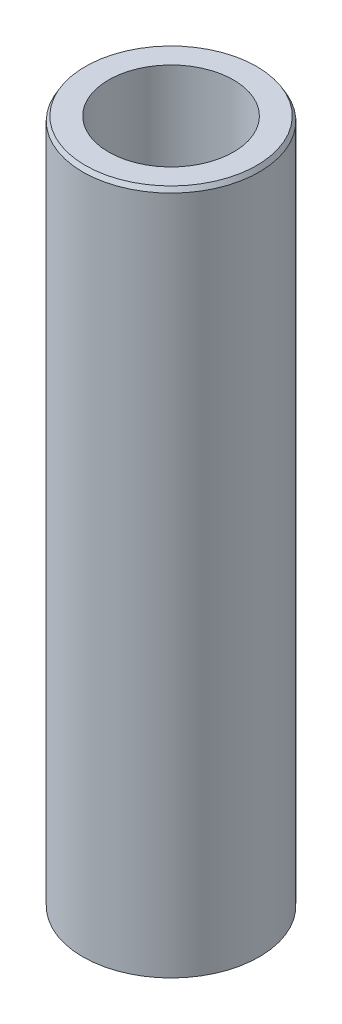
ISO-10303-21;
HEADER;
FILE_DESCRIPTION(('STEP AP214'),'2;1');
FILE_NAME('part.step','',(''),(''),'','','');
FILE_SCHEMA(('AUTOMOTIVE_DESIGN { 1 0 10303 214 1 1 1 1 }'));
ENDSEC;
DATA;
#1=APPLICATION_CONTEXT('core data for automotive mechanical design processes');
#2=APPLICATION_PROTOCOL_DEFINITION('international standard','automotive_design',2000,#1);
#3=PRODUCT_CONTEXT('',#1,'mechanical');
#4=PRODUCT('Part','Part','',(#3));
#5=PRODUCT_RELATED_PRODUCT_CATEGORY('part','',(#4));
#6=PRODUCT_DEFINITION_FORMATION('','',#4);
#7=PRODUCT_DEFINITION_CONTEXT('part definition',#1,'design');
#8=PRODUCT_DEFINITION('design','',#6,#7);
#9=PRODUCT_DEFINITION_SHAPE('','',#8);
#10=(LENGTH_UNIT() NAMED_UNIT(*) SI_UNIT(.MILLI.,.METRE.));
#11=(NAMED_UNIT(*) PLANE_ANGLE_UNIT() SI_UNIT($,.RADIAN.));
#12=(NAMED_UNIT(*) SI_UNIT($,.STERADIAN.) SOLID_ANGLE_UNIT());
#13=UNCERTAINTY_MEASURE_WITH_UNIT(LENGTH_MEASURE(1.E-05),#10,'distance_accuracy_value','');
#14=(GEOMETRIC_REPRESENTATION_CONTEXT(3) GLOBAL_UNCERTAINTY_ASSIGNED_CONTEXT((#13)) GLOBAL_UNIT_ASSIGNED_CONTEXT((#10,
#11,#12)) REPRESENTATION_CONTEXT('',''));
#15=CARTESIAN_POINT('',(0.,0.,0.));
#16=DIRECTION('',(0.,0.,1.));
#17=DIRECTION('',(1.,0.,0.));
#18=AXIS2_PLACEMENT_3D('',#15,#16,#17);
#19=CARTESIAN_POINT('',(0.,194.478352322932,0.));
#20=DIRECTION('',(0.,-1.,0.));
#21=DIRECTION('',(0.,0.,-1.));
#22=AXIS2_PLACEMENT_3D('',#19,#20,#21);
#23=CYLINDRICAL_SURFACE('',#22,25.);
#24=CARTESIAN_POINT('',(0.,193.229659015917,0.));
#25=DIRECTION('',(0.,1.,0.));
#26=DIRECTION('',(0.,0.,1.));
#27=AXIS2_PLACEMENT_3D('',#24,#25,#26);
#28=CIRCLE('',#27,25.);
#29=CARTESIAN_POINT('',(0.,193.229659015917,25.));
#30=VERTEX_POINT('',#29);
#31=EDGE_CURVE('E50',#30,#30,#28,.F.);
#32=ORIENTED_EDGE('',*,*,#31,.T.);
#33=EDGE_LOOP('',(#32));
#34=FACE_BOUND('',#33,.T.);
#35=CARTESIAN_POINT('',(0.,0.720933416940378,0.));
#36=DIRECTION('',(0.,1.,0.));
#37=DIRECTION('',(0.,0.,1.));
#38=AXIS2_PLACEMENT_3D('',#35,#36,#37);
#39=CIRCLE('',#38,25.);
#40=CARTESIAN_POINT('',(0.,0.720933416940378,25.));
#41=VERTEX_POINT('',#40);
#42=EDGE_CURVE('E51',#41,#41,#39,.T.);
#43=ORIENTED_EDGE('',*,*,#42,.T.);
#44=EDGE_LOOP('',(#43));
#45=FACE_BOUND('',#44,.T.);
#46=ADVANCED_FACE('F39',(#34,#45),#23,.T.);
#47=CARTESIAN_POINT('',(0.,194.478352322932,0.));
#48=DIRECTION('',(0.,1.,0.));
#49=DIRECTION('',(0.,0.,1.));
#50=AXIS2_PLACEMENT_3D('',#47,#48,#49);
#51=PLANE('',#50);
#52=CARTESIAN_POINT('',(0.,194.478352322932,0.));
#53=DIRECTION('',(0.,1.,0.));
#54=DIRECTION('',(0.,0.,1.));
#55=AXIS2_PLACEMENT_3D('',#52,#53,#54);
#56=CIRCLE('',#55,24.2790665830596);
#57=CARTESIAN_POINT('',(0.,194.478352322932,24.2790665830596));
#58=VERTEX_POINT('',#57);
#59=EDGE_CURVE('E54',#58,#58,#56,.T.);
#60=ORIENTED_EDGE('',*,*,#59,.T.);
#61=EDGE_LOOP('',(#60));
#62=FACE_BOUND('',#61,.T.);
#63=CARTESIAN_POINT('',(0.,194.478352322932,0.));
#64=DIRECTION('',(0.,1.,0.));
#65=DIRECTION('',(0.,0.,1.));
#66=AXIS2_PLACEMENT_3D('',#63,#64,#65);
#67=CIRCLE('',#66,17.6988823329709);
#68=CARTESIAN_POINT('',(0.,194.478352322932,17.6988823329709));
#69=VERTEX_POINT('',#68);
#70=EDGE_CURVE('E58',#69,#69,#67,.T.);
#71=ORIENTED_EDGE('',*,*,#70,.F.);
#72=EDGE_LOOP('',(#71));
#73=FACE_BOUND('',#72,.T.);
#74=ADVANCED_FACE('F69',(#62,#73),#51,.T.);
#75=CARTESIAN_POINT('',(0.,0.,0.));
#76=DIRECTION('',(0.,1.,0.));
#77=DIRECTION('',(0.,0.,1.));
#78=AXIS2_PLACEMENT_3D('',#75,#76,#77);
#79=PLANE('',#78);
#80=CARTESIAN_POINT('',(0.,0.,0.));
#81=DIRECTION('',(0.,1.,0.));
#82=DIRECTION('',(0.,0.,1.));
#83=AXIS2_PLACEMENT_3D('',#80,#81,#82);
#84=CIRCLE('',#83,23.7513066929851);
#85=CARTESIAN_POINT('',(0.,0.,23.7513066929851));
#86=VERTEX_POINT('',#85);
#87=EDGE_CURVE('E10',#86,#86,#84,.F.);
#88=ORIENTED_EDGE('',*,*,#87,.T.);
#89=EDGE_LOOP('',(#88));
#90=FACE_BOUND('',#89,.T.);
#91=CARTESIAN_POINT('',(0.,0.,0.));
#92=DIRECTION('',(0.,1.,0.));
#93=DIRECTION('',(0.,0.,1.));
#94=AXIS2_PLACEMENT_3D('',#91,#92,#93);
#95=CIRCLE('',#94,17.6988823329709);
#96=CARTESIAN_POINT('',(0.,0.,17.6988823329709));
#97=VERTEX_POINT('',#96);
#98=EDGE_CURVE('E63',#97,#97,#95,.T.);
#99=ORIENTED_EDGE('',*,*,#98,.T.);
#100=EDGE_LOOP('',(#99));
#101=FACE_BOUND('',#100,.T.);
#102=ADVANCED_FACE('F75',(#90,#101),#79,.F.);
#103=CARTESIAN_POINT('',(0.,194.478352322932,0.));
#104=DIRECTION('',(0.,-1.,0.));
#105=DIRECTION('',(0.,0.,-1.));
#106=AXIS2_PLACEMENT_3D('',#103,#104,#105);
#107=CYLINDRICAL_SURFACE('',#106,17.6988823329709);
#108=ORIENTED_EDGE('',*,*,#70,.T.);
#109=EDGE_LOOP('',(#108));
#110=FACE_BOUND('',#109,.T.);
#111=ORIENTED_EDGE('',*,*,#98,.F.);
#112=EDGE_LOOP('',(#111));
#113=FACE_BOUND('',#112,.T.);
#114=ADVANCED_FACE('F70',(#110,#113),#107,.F.);
#115=CARTESIAN_POINT('',(0.,194.478352322932,0.));
#116=DIRECTION('',(0.,-1.,0.));
#117=DIRECTION('',(0.,0.,-1.));
#118=AXIS2_PLACEMENT_3D('',#115,#116,#117);
#119=CONICAL_SURFACE('',#118,24.2790665830596,0.523598775598303);
#120=ORIENTED_EDGE('',*,*,#31,.F.);
#121=EDGE_LOOP('',(#120));
#122=FACE_BOUND('',#121,.T.);
#123=ORIENTED_EDGE('',*,*,#59,.F.);
#124=EDGE_LOOP('',(#123));
#125=FACE_BOUND('',#124,.T.);
#126=ADVANCED_FACE('F81',(#122,#125),#119,.T.);
#127=CARTESIAN_POINT('',(0.,0.720933416940378,0.));
#128=DIRECTION('',(0.,1.,0.));
#129=DIRECTION('',(0.,0.,1.));
#130=AXIS2_PLACEMENT_3D('',#127,#128,#129);
#131=CONICAL_SURFACE('',#130,25.,1.04719755119659);
#132=ORIENTED_EDGE('',*,*,#87,.F.);
#133=EDGE_LOOP('',(#132));
#134=FACE_BOUND('',#133,.T.);
#135=ORIENTED_EDGE('',*,*,#42,.F.);
#136=EDGE_LOOP('',(#135));
#137=FACE_BOUND('',#136,.T.);
#138=ADVANCED_FACE('F45',(#134,#137),#131,.T.);
#139=CLOSED_SHELL('',(#46,#74,#102,#114,#126,#138));
#140=MANIFOLD_SOLID_BREP('B2',#139);
#141=ADVANCED_BREP_SHAPE_REPRESENTATION('',(#18,#140),#14);
#142=SHAPE_DEFINITION_REPRESENTATION(#9,#141);
ENDSEC;
END-ISO-10303-21;
